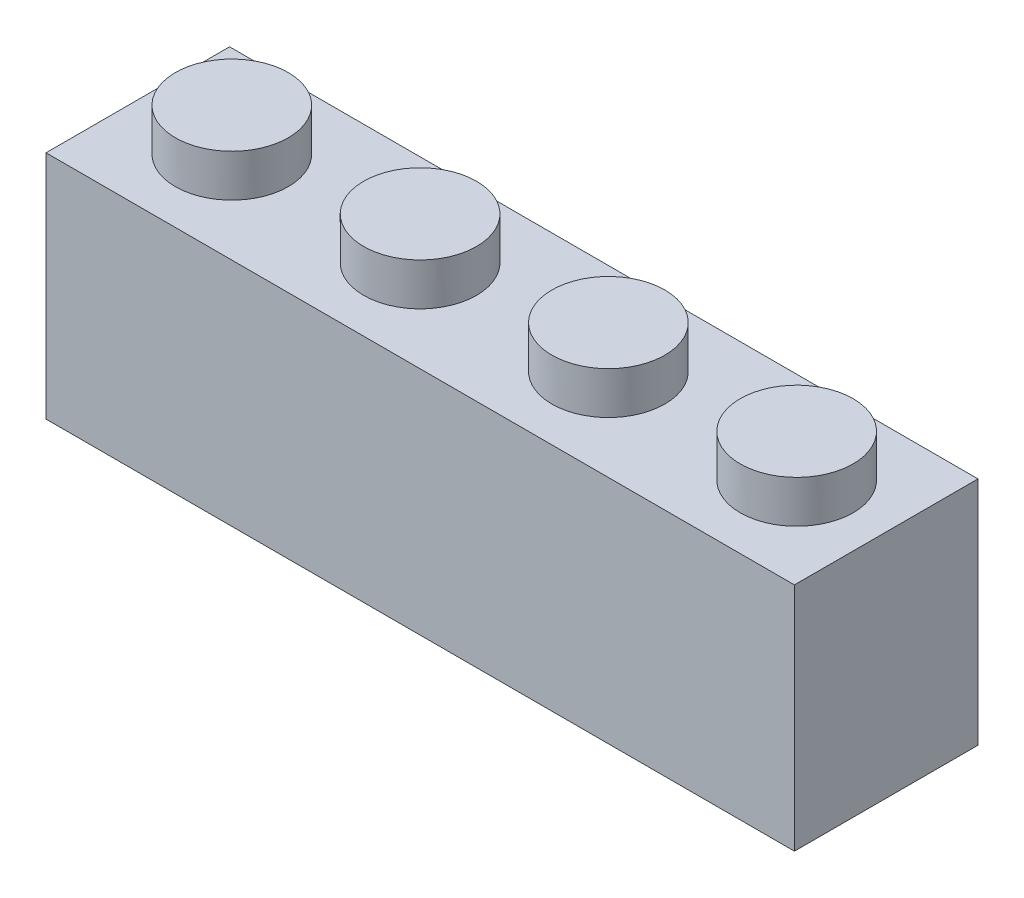
ISO-10303-21;
HEADER;
FILE_DESCRIPTION(('STEP AP214'),'2;1');
FILE_NAME('part.step','',(''),(''),'','','');
FILE_SCHEMA(('AUTOMOTIVE_DESIGN { 1 0 10303 214 1 1 1 1 }'));
ENDSEC;
DATA;
#1=APPLICATION_CONTEXT('core data for automotive mechanical design processes');
#2=APPLICATION_PROTOCOL_DEFINITION('international standard','automotive_design',2000,#1);
#3=PRODUCT_CONTEXT('',#1,'mechanical');
#4=PRODUCT('Part','Part','',(#3));
#5=PRODUCT_RELATED_PRODUCT_CATEGORY('part','',(#4));
#6=PRODUCT_DEFINITION_FORMATION('','',#4);
#7=PRODUCT_DEFINITION_CONTEXT('part definition',#1,'design');
#8=PRODUCT_DEFINITION('design','',#6,#7);
#9=PRODUCT_DEFINITION_SHAPE('','',#8);
#10=(LENGTH_UNIT() NAMED_UNIT(*) SI_UNIT(.MILLI.,.METRE.));
#11=(NAMED_UNIT(*) PLANE_ANGLE_UNIT() SI_UNIT($,.RADIAN.));
#12=(NAMED_UNIT(*) SI_UNIT($,.STERADIAN.) SOLID_ANGLE_UNIT());
#13=UNCERTAINTY_MEASURE_WITH_UNIT(LENGTH_MEASURE(1.E-05),#10,'distance_accuracy_value','');
#14=(GEOMETRIC_REPRESENTATION_CONTEXT(3) GLOBAL_UNCERTAINTY_ASSIGNED_CONTEXT((#13)) GLOBAL_UNIT_ASSIGNED_CONTEXT((#10,
#11,#12)) REPRESENTATION_CONTEXT('',''));
#15=CARTESIAN_POINT('',(0.,0.,0.));
#16=DIRECTION('',(0.,0.,1.));
#17=DIRECTION('',(1.,0.,0.));
#18=AXIS2_PLACEMENT_3D('',#15,#16,#17);
#19=CARTESIAN_POINT('',(15.9,4.9,-3.9));
#20=DIRECTION('',(-1.,0.,0.));
#21=DIRECTION('',(0.,0.,1.));
#22=AXIS2_PLACEMENT_3D('',#19,#20,#21);
#23=PLANE('',#22);
#24=DIRECTION('',(0.,0.,-1.));
#25=VECTOR('',#24,1.);
#26=CARTESIAN_POINT('',(15.9,-4.9,-3.9));
#27=LINE('',#26,#25);
#28=CARTESIAN_POINT('',(15.9,-4.9,3.9));
#29=VERTEX_POINT('',#28);
#30=CARTESIAN_POINT('',(15.9,-4.9,-3.9));
#31=VERTEX_POINT('',#30);
#32=EDGE_CURVE('E160',#29,#31,#27,.T.);
#33=ORIENTED_EDGE('',*,*,#32,.T.);
#34=DIRECTION('',(0.,-1.,0.));
#35=VECTOR('',#34,1.);
#36=CARTESIAN_POINT('',(15.9,4.9,-3.9));
#37=LINE('',#36,#35);
#38=CARTESIAN_POINT('',(15.9,4.9,-3.9));
#39=VERTEX_POINT('',#38);
#40=EDGE_CURVE('E181',#39,#31,#37,.T.);
#41=ORIENTED_EDGE('',*,*,#40,.F.);
#42=DIRECTION('',(0.,0.,-1.));
#43=VECTOR('',#42,1.);
#44=CARTESIAN_POINT('',(15.9,4.9,-3.9));
#45=LINE('',#44,#43);
#46=CARTESIAN_POINT('',(15.9,4.9,3.9));
#47=VERTEX_POINT('',#46);
#48=EDGE_CURVE('E161',#47,#39,#45,.T.);
#49=ORIENTED_EDGE('',*,*,#48,.F.);
#50=DIRECTION('',(0.,-1.,0.));
#51=VECTOR('',#50,1.);
#52=CARTESIAN_POINT('',(15.9,4.9,3.9));
#53=LINE('',#52,#51);
#54=EDGE_CURVE('E167',#47,#29,#53,.T.);
#55=ORIENTED_EDGE('',*,*,#54,.T.);
#56=EDGE_LOOP('',(#33,#41,#49,#55));
#57=FACE_BOUND('',#56,.T.);
#58=ADVANCED_FACE('F33',(#57),#23,.F.);
#59=CARTESIAN_POINT('',(-15.9,4.9,-3.9));
#60=DIRECTION('',(0.,0.,1.));
#61=DIRECTION('',(1.,0.,0.));
#62=AXIS2_PLACEMENT_3D('',#59,#60,#61);
#63=PLANE('',#62);
#64=DIRECTION('',(-1.,0.,0.));
#65=VECTOR('',#64,1.);
#66=CARTESIAN_POINT('',(-15.9,-4.9,-3.9));
#67=LINE('',#66,#65);
#68=CARTESIAN_POINT('',(-15.9,-4.9,-3.9));
#69=VERTEX_POINT('',#68);
#70=EDGE_CURVE('E170',#31,#69,#67,.T.);
#71=ORIENTED_EDGE('',*,*,#70,.T.);
#72=DIRECTION('',(0.,-1.,0.));
#73=VECTOR('',#72,1.);
#74=CARTESIAN_POINT('',(-15.9,4.9,-3.9));
#75=LINE('',#74,#73);
#76=CARTESIAN_POINT('',(-15.9,4.9,-3.9));
#77=VERTEX_POINT('',#76);
#78=EDGE_CURVE('E178',#77,#69,#75,.T.);
#79=ORIENTED_EDGE('',*,*,#78,.F.);
#80=DIRECTION('',(-1.,0.,0.));
#81=VECTOR('',#80,1.);
#82=CARTESIAN_POINT('',(-15.9,4.9,-3.9));
#83=LINE('',#82,#81);
#84=EDGE_CURVE('E85',#39,#77,#83,.T.);
#85=ORIENTED_EDGE('',*,*,#84,.F.);
#86=ORIENTED_EDGE('',*,*,#40,.T.);
#87=EDGE_LOOP('',(#71,#79,#85,#86));
#88=FACE_BOUND('',#87,.T.);
#89=ADVANCED_FACE('F220',(#88),#63,.F.);
#90=CARTESIAN_POINT('',(-15.9,4.9,-3.9));
#91=DIRECTION('',(1.,0.,0.));
#92=DIRECTION('',(0.,0.,-1.));
#93=AXIS2_PLACEMENT_3D('',#90,#91,#92);
#94=PLANE('',#93);
#95=DIRECTION('',(0.,0.,1.));
#96=VECTOR('',#95,1.);
#97=CARTESIAN_POINT('',(-15.9,-4.9,-3.9));
#98=LINE('',#97,#96);
#99=CARTESIAN_POINT('',(-15.9,-4.9,3.9));
#100=VERTEX_POINT('',#99);
#101=EDGE_CURVE('E172',#69,#100,#98,.T.);
#102=ORIENTED_EDGE('',*,*,#101,.T.);
#103=DIRECTION('',(0.,-1.,0.));
#104=VECTOR('',#103,1.);
#105=CARTESIAN_POINT('',(-15.9,4.9,3.9));
#106=LINE('',#105,#104);
#107=CARTESIAN_POINT('',(-15.9,4.9,3.9));
#108=VERTEX_POINT('',#107);
#109=EDGE_CURVE('E176',#108,#100,#106,.T.);
#110=ORIENTED_EDGE('',*,*,#109,.F.);
#111=DIRECTION('',(0.,0.,1.));
#112=VECTOR('',#111,1.);
#113=CARTESIAN_POINT('',(-15.9,4.9,-3.9));
#114=LINE('',#113,#112);
#115=EDGE_CURVE('E164',#77,#108,#114,.T.);
#116=ORIENTED_EDGE('',*,*,#115,.F.);
#117=ORIENTED_EDGE('',*,*,#78,.T.);
#118=EDGE_LOOP('',(#102,#110,#116,#117));
#119=FACE_BOUND('',#118,.T.);
#120=ADVANCED_FACE('F225',(#119),#94,.F.);
#121=CARTESIAN_POINT('',(-15.9,4.9,3.9));
#122=DIRECTION('',(0.,0.,-1.));
#123=DIRECTION('',(-1.,0.,0.));
#124=AXIS2_PLACEMENT_3D('',#121,#122,#123);
#125=PLANE('',#124);
#126=DIRECTION('',(1.,0.,0.));
#127=VECTOR('',#126,1.);
#128=CARTESIAN_POINT('',(-15.9,-4.9,3.9));
#129=LINE('',#128,#127);
#130=EDGE_CURVE('E77',#100,#29,#129,.T.);
#131=ORIENTED_EDGE('',*,*,#130,.T.);
#132=ORIENTED_EDGE('',*,*,#54,.F.);
#133=DIRECTION('',(1.,0.,0.));
#134=VECTOR('',#133,1.);
#135=CARTESIAN_POINT('',(-15.9,4.9,3.9));
#136=LINE('',#135,#134);
#137=EDGE_CURVE('E56',#108,#47,#136,.T.);
#138=ORIENTED_EDGE('',*,*,#137,.F.);
#139=ORIENTED_EDGE('',*,*,#109,.T.);
#140=EDGE_LOOP('',(#131,#132,#138,#139));
#141=FACE_BOUND('',#140,.T.);
#142=ADVANCED_FACE('F237',(#141),#125,.F.);
#143=CARTESIAN_POINT('',(0.,4.9,0.));
#144=DIRECTION('',(0.,1.,0.));
#145=DIRECTION('',(0.,0.,1.));
#146=AXIS2_PLACEMENT_3D('',#143,#144,#145);
#147=PLANE('',#146);
#148=CARTESIAN_POINT('',(12.0951920976153,4.9,0.));
#149=DIRECTION('',(0.,1.,0.));
#150=DIRECTION('',(0.,0.,1.));
#151=AXIS2_PLACEMENT_3D('',#148,#149,#150);
#152=CIRCLE('',#151,2.4);
#153=CARTESIAN_POINT('',(12.0951920976153,4.9,2.4));
#154=VERTEX_POINT('',#153);
#155=EDGE_CURVE('E192',#154,#154,#152,.T.);
#156=ORIENTED_EDGE('',*,*,#155,.F.);
#157=EDGE_LOOP('',(#156));
#158=FACE_BOUND('',#157,.T.);
#159=CARTESIAN_POINT('',(4.09519209761529,4.9,0.));
#160=DIRECTION('',(0.,1.,0.));
#161=DIRECTION('',(0.,0.,1.));
#162=AXIS2_PLACEMENT_3D('',#159,#160,#161);
#163=CIRCLE('',#162,2.4);
#164=CARTESIAN_POINT('',(4.09519209761529,4.9,2.4));
#165=VERTEX_POINT('',#164);
#166=EDGE_CURVE('E189',#165,#165,#163,.T.);
#167=ORIENTED_EDGE('',*,*,#166,.F.);
#168=EDGE_LOOP('',(#167));
#169=FACE_BOUND('',#168,.T.);
#170=CARTESIAN_POINT('',(-3.90480790238471,4.9,0.));
#171=DIRECTION('',(0.,1.,0.));
#172=DIRECTION('',(0.,0.,1.));
#173=AXIS2_PLACEMENT_3D('',#170,#171,#172);
#174=CIRCLE('',#173,2.4);
#175=CARTESIAN_POINT('',(-3.90480790238471,4.9,2.4));
#176=VERTEX_POINT('',#175);
#177=EDGE_CURVE('E186',#176,#176,#174,.T.);
#178=ORIENTED_EDGE('',*,*,#177,.F.);
#179=EDGE_LOOP('',(#178));
#180=FACE_BOUND('',#179,.T.);
#181=CARTESIAN_POINT('',(-11.9048079023847,4.9,0.));
#182=DIRECTION('',(0.,1.,0.));
#183=DIRECTION('',(0.,0.,1.));
#184=AXIS2_PLACEMENT_3D('',#181,#182,#183);
#185=CIRCLE('',#184,2.4);
#186=CARTESIAN_POINT('',(-11.9048079023847,4.9,2.4));
#187=VERTEX_POINT('',#186);
#188=EDGE_CURVE('E183',#187,#187,#185,.T.);
#189=ORIENTED_EDGE('',*,*,#188,.F.);
#190=EDGE_LOOP('',(#189));
#191=FACE_BOUND('',#190,.T.);
#192=ORIENTED_EDGE('',*,*,#48,.T.);
#193=ORIENTED_EDGE('',*,*,#84,.T.);
#194=ORIENTED_EDGE('',*,*,#115,.T.);
#195=ORIENTED_EDGE('',*,*,#137,.T.);
#196=EDGE_LOOP('',(#192,#193,#194,#195));
#197=FACE_BOUND('',#196,.T.);
#198=ADVANCED_FACE('F235',(#158,#169,#180,#191,#197),#147,.T.);
#199=CARTESIAN_POINT('',(0.,-4.9,0.));
#200=DIRECTION('',(0.,1.,0.));
#201=DIRECTION('',(0.,0.,1.));
#202=AXIS2_PLACEMENT_3D('',#199,#200,#201);
#203=PLANE('',#202);
#204=DIRECTION('',(-1.,0.,0.));
#205=VECTOR('',#204,1.);
#206=CARTESIAN_POINT('',(-14.3,-4.9,2.3));
#207=LINE('',#206,#205);
#208=CARTESIAN_POINT('',(14.3,-4.9,2.3));
#209=VERTEX_POINT('',#208);
#210=CARTESIAN_POINT('',(-14.3,-4.9,2.3));
#211=VERTEX_POINT('',#210);
#212=EDGE_CURVE('E139',#209,#211,#207,.T.);
#213=ORIENTED_EDGE('',*,*,#212,.F.);
#214=DIRECTION('',(0.,0.,1.));
#215=VECTOR('',#214,1.);
#216=CARTESIAN_POINT('',(14.3,-4.9,-2.3));
#217=LINE('',#216,#215);
#218=CARTESIAN_POINT('',(14.3,-4.9,-2.3));
#219=VERTEX_POINT('',#218);
#220=EDGE_CURVE('E47',#219,#209,#217,.T.);
#221=ORIENTED_EDGE('',*,*,#220,.F.);
#222=DIRECTION('',(1.,0.,0.));
#223=VECTOR('',#222,1.);
#224=CARTESIAN_POINT('',(-14.3,-4.9,-2.3));
#225=LINE('',#224,#223);
#226=CARTESIAN_POINT('',(-14.3,-4.9,-2.3));
#227=VERTEX_POINT('',#226);
#228=EDGE_CURVE('E127',#227,#219,#225,.T.);
#229=ORIENTED_EDGE('',*,*,#228,.F.);
#230=DIRECTION('',(0.,0.,-1.));
#231=VECTOR('',#230,1.);
#232=CARTESIAN_POINT('',(-14.3,-4.9,-2.3));
#233=LINE('',#232,#231);
#234=EDGE_CURVE('E130',#211,#227,#233,.T.);
#235=ORIENTED_EDGE('',*,*,#234,.F.);
#236=EDGE_LOOP('',(#213,#221,#229,#235));
#237=FACE_BOUND('',#236,.T.);
#238=ORIENTED_EDGE('',*,*,#32,.F.);
#239=ORIENTED_EDGE('',*,*,#130,.F.);
#240=ORIENTED_EDGE('',*,*,#101,.F.);
#241=ORIENTED_EDGE('',*,*,#70,.F.);
#242=EDGE_LOOP('',(#238,#239,#240,#241));
#243=FACE_BOUND('',#242,.T.);
#244=ADVANCED_FACE('F230',(#237,#243),#203,.F.);
#245=CARTESIAN_POINT('',(-11.9048079023847,6.7,0.));
#246=DIRECTION('',(0.,-1.,0.));
#247=DIRECTION('',(0.,0.,-1.));
#248=AXIS2_PLACEMENT_3D('',#245,#246,#247);
#249=CYLINDRICAL_SURFACE('',#248,2.4);
#250=CARTESIAN_POINT('',(-11.9048079023847,6.7,0.));
#251=DIRECTION('',(0.,-1.,0.));
#252=DIRECTION('',(0.,0.,-1.));
#253=AXIS2_PLACEMENT_3D('',#250,#251,#252);
#254=CIRCLE('',#253,2.4);
#255=CARTESIAN_POINT('',(-11.9048079023847,6.7,-2.4));
#256=VERTEX_POINT('',#255);
#257=EDGE_CURVE('E157',#256,#256,#254,.T.);
#258=ORIENTED_EDGE('',*,*,#257,.T.);
#259=EDGE_LOOP('',(#258));
#260=FACE_BOUND('',#259,.T.);
#261=ORIENTED_EDGE('',*,*,#188,.T.);
#262=EDGE_LOOP('',(#261));
#263=FACE_BOUND('',#262,.T.);
#264=ADVANCED_FACE('F244',(#260,#263),#249,.T.);
#265=CARTESIAN_POINT('',(-11.9048079023847,6.7,0.));
#266=DIRECTION('',(0.,-1.,0.));
#267=DIRECTION('',(0.,0.,-1.));
#268=AXIS2_PLACEMENT_3D('',#265,#266,#267);
#269=PLANE('',#268);
#270=ORIENTED_EDGE('',*,*,#257,.F.);
#271=EDGE_LOOP('',(#270));
#272=FACE_BOUND('',#271,.T.);
#273=ADVANCED_FACE('F276',(#272),#269,.F.);
#274=CARTESIAN_POINT('',(-3.90480790238471,6.7,0.));
#275=DIRECTION('',(0.,-1.,0.));
#276=DIRECTION('',(0.,0.,-1.));
#277=AXIS2_PLACEMENT_3D('',#274,#275,#276);
#278=CYLINDRICAL_SURFACE('',#277,2.4);
#279=CARTESIAN_POINT('',(-3.90480790238471,6.7,0.));
#280=DIRECTION('',(0.,-1.,0.));
#281=DIRECTION('',(0.,0.,-1.));
#282=AXIS2_PLACEMENT_3D('',#279,#280,#281);
#283=CIRCLE('',#282,2.4);
#284=CARTESIAN_POINT('',(-3.90480790238471,6.7,-2.4));
#285=VERTEX_POINT('',#284);
#286=EDGE_CURVE('E154',#285,#285,#283,.T.);
#287=ORIENTED_EDGE('',*,*,#286,.T.);
#288=EDGE_LOOP('',(#287));
#289=FACE_BOUND('',#288,.T.);
#290=ORIENTED_EDGE('',*,*,#177,.T.);
#291=EDGE_LOOP('',(#290));
#292=FACE_BOUND('',#291,.T.);
#293=ADVANCED_FACE('F285',(#289,#292),#278,.T.);
#294=CARTESIAN_POINT('',(-3.90480790238471,6.7,0.));
#295=DIRECTION('',(0.,-1.,0.));
#296=DIRECTION('',(0.,0.,-1.));
#297=AXIS2_PLACEMENT_3D('',#294,#295,#296);
#298=PLANE('',#297);
#299=ORIENTED_EDGE('',*,*,#286,.F.);
#300=EDGE_LOOP('',(#299));
#301=FACE_BOUND('',#300,.T.);
#302=ADVANCED_FACE('F294',(#301),#298,.F.);
#303=CARTESIAN_POINT('',(4.09519209761529,6.7,0.));
#304=DIRECTION('',(0.,-1.,0.));
#305=DIRECTION('',(0.,0.,-1.));
#306=AXIS2_PLACEMENT_3D('',#303,#304,#305);
#307=CYLINDRICAL_SURFACE('',#306,2.4);
#308=CARTESIAN_POINT('',(4.09519209761529,6.7,0.));
#309=DIRECTION('',(0.,-1.,0.));
#310=DIRECTION('',(0.,0.,-1.));
#311=AXIS2_PLACEMENT_3D('',#308,#309,#310);
#312=CIRCLE('',#311,2.4);
#313=CARTESIAN_POINT('',(4.09519209761529,6.7,-2.4));
#314=VERTEX_POINT('',#313);
#315=EDGE_CURVE('E151',#314,#314,#312,.T.);
#316=ORIENTED_EDGE('',*,*,#315,.T.);
#317=EDGE_LOOP('',(#316));
#318=FACE_BOUND('',#317,.T.);
#319=ORIENTED_EDGE('',*,*,#166,.T.);
#320=EDGE_LOOP('',(#319));
#321=FACE_BOUND('',#320,.T.);
#322=ADVANCED_FACE('F304',(#318,#321),#307,.T.);
#323=CARTESIAN_POINT('',(4.09519209761529,6.7,0.));
#324=DIRECTION('',(0.,-1.,0.));
#325=DIRECTION('',(0.,0.,-1.));
#326=AXIS2_PLACEMENT_3D('',#323,#324,#325);
#327=PLANE('',#326);
#328=ORIENTED_EDGE('',*,*,#315,.F.);
#329=EDGE_LOOP('',(#328));
#330=FACE_BOUND('',#329,.T.);
#331=ADVANCED_FACE('F314',(#330),#327,.F.);
#332=CARTESIAN_POINT('',(12.0951920976153,6.7,0.));
#333=DIRECTION('',(0.,-1.,0.));
#334=DIRECTION('',(0.,0.,-1.));
#335=AXIS2_PLACEMENT_3D('',#332,#333,#334);
#336=CYLINDRICAL_SURFACE('',#335,2.4);
#337=CARTESIAN_POINT('',(12.0951920976153,6.7,0.));
#338=DIRECTION('',(0.,-1.,0.));
#339=DIRECTION('',(0.,0.,-1.));
#340=AXIS2_PLACEMENT_3D('',#337,#338,#339);
#341=CIRCLE('',#340,2.4);
#342=CARTESIAN_POINT('',(12.0951920976153,6.7,-2.4));
#343=VERTEX_POINT('',#342);
#344=EDGE_CURVE('E145',#343,#343,#341,.T.);
#345=ORIENTED_EDGE('',*,*,#344,.T.);
#346=EDGE_LOOP('',(#345));
#347=FACE_BOUND('',#346,.T.);
#348=ORIENTED_EDGE('',*,*,#155,.T.);
#349=EDGE_LOOP('',(#348));
#350=FACE_BOUND('',#349,.T.);
#351=ADVANCED_FACE('F324',(#347,#350),#336,.T.);
#352=CARTESIAN_POINT('',(12.0951920976153,6.7,0.));
#353=DIRECTION('',(0.,-1.,0.));
#354=DIRECTION('',(0.,0.,-1.));
#355=AXIS2_PLACEMENT_3D('',#352,#353,#354);
#356=PLANE('',#355);
#357=ORIENTED_EDGE('',*,*,#344,.F.);
#358=EDGE_LOOP('',(#357));
#359=FACE_BOUND('',#358,.T.);
#360=ADVANCED_FACE('F334',(#359),#356,.F.);
#361=CARTESIAN_POINT('',(14.3,3.1,-2.3));
#362=DIRECTION('',(1.,0.,0.));
#363=DIRECTION('',(0.,0.,-1.));
#364=AXIS2_PLACEMENT_3D('',#361,#362,#363);
#365=PLANE('',#364);
#366=ORIENTED_EDGE('',*,*,#220,.T.);
#367=DIRECTION('',(0.,-1.,0.));
#368=VECTOR('',#367,1.);
#369=CARTESIAN_POINT('',(14.3,3.1,2.3));
#370=LINE('',#369,#368);
#371=CARTESIAN_POINT('',(14.3,3.1,2.3));
#372=VERTEX_POINT('',#371);
#373=EDGE_CURVE('E105',#372,#209,#370,.T.);
#374=ORIENTED_EDGE('',*,*,#373,.F.);
#375=DIRECTION('',(0.,0.,1.));
#376=VECTOR('',#375,1.);
#377=CARTESIAN_POINT('',(14.3,3.1,-2.3));
#378=LINE('',#377,#376);
#379=CARTESIAN_POINT('',(14.3,3.1,-2.3));
#380=VERTEX_POINT('',#379);
#381=EDGE_CURVE('E109',#380,#372,#378,.T.);
#382=ORIENTED_EDGE('',*,*,#381,.F.);
#383=DIRECTION('',(0.,-1.,0.));
#384=VECTOR('',#383,1.);
#385=CARTESIAN_POINT('',(14.3,3.1,-2.3));
#386=LINE('',#385,#384);
#387=EDGE_CURVE('E143',#380,#219,#386,.T.);
#388=ORIENTED_EDGE('',*,*,#387,.T.);
#389=EDGE_LOOP('',(#366,#374,#382,#388));
#390=FACE_BOUND('',#389,.T.);
#391=ADVANCED_FACE('F107',(#390),#365,.F.);
#392=CARTESIAN_POINT('',(-14.3,3.1,-2.3));
#393=DIRECTION('',(0.,0.,-1.));
#394=DIRECTION('',(-1.,0.,0.));
#395=AXIS2_PLACEMENT_3D('',#392,#393,#394);
#396=PLANE('',#395);
#397=ORIENTED_EDGE('',*,*,#228,.T.);
#398=ORIENTED_EDGE('',*,*,#387,.F.);
#399=DIRECTION('',(1.,0.,0.));
#400=VECTOR('',#399,1.);
#401=CARTESIAN_POINT('',(-14.3,3.1,-2.3));
#402=LINE('',#401,#400);
#403=CARTESIAN_POINT('',(-14.3,3.1,-2.3));
#404=VERTEX_POINT('',#403);
#405=EDGE_CURVE('E115',#404,#380,#402,.T.);
#406=ORIENTED_EDGE('',*,*,#405,.F.);
#407=DIRECTION('',(0.,-1.,0.));
#408=VECTOR('',#407,1.);
#409=CARTESIAN_POINT('',(-14.3,3.1,-2.3));
#410=LINE('',#409,#408);
#411=EDGE_CURVE('E146',#404,#227,#410,.T.);
#412=ORIENTED_EDGE('',*,*,#411,.T.);
#413=EDGE_LOOP('',(#397,#398,#406,#412));
#414=FACE_BOUND('',#413,.T.);
#415=ADVANCED_FACE('F358',(#414),#396,.F.);
#416=CARTESIAN_POINT('',(-14.3,3.1,-2.3));
#417=DIRECTION('',(-1.,0.,0.));
#418=DIRECTION('',(0.,0.,1.));
#419=AXIS2_PLACEMENT_3D('',#416,#417,#418);
#420=PLANE('',#419);
#421=ORIENTED_EDGE('',*,*,#234,.T.);
#422=ORIENTED_EDGE('',*,*,#411,.F.);
#423=DIRECTION('',(0.,0.,-1.));
#424=VECTOR('',#423,1.);
#425=CARTESIAN_POINT('',(-14.3,3.1,-2.3));
#426=LINE('',#425,#424);
#427=CARTESIAN_POINT('',(-14.3,3.1,2.3));
#428=VERTEX_POINT('',#427);
#429=EDGE_CURVE('E123',#428,#404,#426,.T.);
#430=ORIENTED_EDGE('',*,*,#429,.F.);
#431=DIRECTION('',(0.,-1.,0.));
#432=VECTOR('',#431,1.);
#433=CARTESIAN_POINT('',(-14.3,3.1,2.3));
#434=LINE('',#433,#432);
#435=EDGE_CURVE('E114',#428,#211,#434,.T.);
#436=ORIENTED_EDGE('',*,*,#435,.T.);
#437=EDGE_LOOP('',(#421,#422,#430,#436));
#438=FACE_BOUND('',#437,.T.);
#439=ADVANCED_FACE('F367',(#438),#420,.F.);
#440=CARTESIAN_POINT('',(-14.3,3.1,2.3));
#441=DIRECTION('',(0.,0.,1.));
#442=DIRECTION('',(1.,0.,0.));
#443=AXIS2_PLACEMENT_3D('',#440,#441,#442);
#444=PLANE('',#443);
#445=ORIENTED_EDGE('',*,*,#212,.T.);
#446=ORIENTED_EDGE('',*,*,#435,.F.);
#447=DIRECTION('',(-1.,0.,0.));
#448=VECTOR('',#447,1.);
#449=CARTESIAN_POINT('',(-14.3,3.1,2.3));
#450=LINE('',#449,#448);
#451=EDGE_CURVE('E118',#372,#428,#450,.T.);
#452=ORIENTED_EDGE('',*,*,#451,.F.);
#453=ORIENTED_EDGE('',*,*,#373,.T.);
#454=EDGE_LOOP('',(#445,#446,#452,#453));
#455=FACE_BOUND('',#454,.T.);
#456=ADVANCED_FACE('F119',(#455),#444,.F.);
#457=CARTESIAN_POINT('',(0.,3.1,0.));
#458=DIRECTION('',(0.,1.,0.));
#459=DIRECTION('',(0.,0.,1.));
#460=AXIS2_PLACEMENT_3D('',#457,#458,#459);
#461=PLANE('',#460);
#462=CARTESIAN_POINT('',(-7.95,3.1,0.));
#463=DIRECTION('',(0.,1.,0.));
#464=DIRECTION('',(0.,0.,1.));
#465=AXIS2_PLACEMENT_3D('',#462,#463,#464);
#466=CIRCLE('',#465,1.5);
#467=CARTESIAN_POINT('',(-7.95,3.1,1.5));
#468=VERTEX_POINT('',#467);
#469=EDGE_CURVE('E11',#468,#468,#466,.F.);
#470=ORIENTED_EDGE('',*,*,#469,.F.);
#471=EDGE_LOOP('',(#470));
#472=FACE_BOUND('',#471,.T.);
#473=CARTESIAN_POINT('',(0.,3.1,0.));
#474=DIRECTION('',(0.,1.,0.));
#475=DIRECTION('',(0.,0.,1.));
#476=AXIS2_PLACEMENT_3D('',#473,#474,#475);
#477=CIRCLE('',#476,1.5);
#478=CARTESIAN_POINT('',(0.,3.1,1.5));
#479=VERTEX_POINT('',#478);
#480=EDGE_CURVE('E40',#479,#479,#477,.F.);
#481=ORIENTED_EDGE('',*,*,#480,.F.);
#482=EDGE_LOOP('',(#481));
#483=FACE_BOUND('',#482,.T.);
#484=CARTESIAN_POINT('',(7.95,3.1,0.));
#485=DIRECTION('',(0.,1.,0.));
#486=DIRECTION('',(0.,0.,1.));
#487=AXIS2_PLACEMENT_3D('',#484,#485,#486);
#488=CIRCLE('',#487,1.5);
#489=CARTESIAN_POINT('',(7.95,3.1,1.5));
#490=VERTEX_POINT('',#489);
#491=EDGE_CURVE('E195',#490,#490,#488,.F.);
#492=ORIENTED_EDGE('',*,*,#491,.F.);
#493=EDGE_LOOP('',(#492));
#494=FACE_BOUND('',#493,.T.);
#495=ORIENTED_EDGE('',*,*,#381,.T.);
#496=ORIENTED_EDGE('',*,*,#451,.T.);
#497=ORIENTED_EDGE('',*,*,#429,.T.);
#498=ORIENTED_EDGE('',*,*,#405,.T.);
#499=EDGE_LOOP('',(#495,#496,#497,#498));
#500=FACE_BOUND('',#499,.T.);
#501=ADVANCED_FACE('F125',(#472,#483,#494,#500),#461,.F.);
#502=CARTESIAN_POINT('',(7.95,-4.7,0.));
#503=DIRECTION('',(0.,1.,0.));
#504=DIRECTION('',(0.,0.,1.));
#505=AXIS2_PLACEMENT_3D('',#502,#503,#504);
#506=CYLINDRICAL_SURFACE('',#505,1.5);
#507=CARTESIAN_POINT('',(7.95,-4.7,0.));
#508=DIRECTION('',(0.,-1.,0.));
#509=DIRECTION('',(0.,0.,-1.));
#510=AXIS2_PLACEMENT_3D('',#507,#508,#509);
#511=CIRCLE('',#510,1.5);
#512=CARTESIAN_POINT('',(7.95,-4.7,-1.5));
#513=VERTEX_POINT('',#512);
#514=EDGE_CURVE('E133',#513,#513,#511,.T.);
#515=ORIENTED_EDGE('',*,*,#514,.F.);
#516=EDGE_LOOP('',(#515));
#517=FACE_BOUND('',#516,.T.);
#518=ORIENTED_EDGE('',*,*,#491,.T.);
#519=EDGE_LOOP('',(#518));
#520=FACE_BOUND('',#519,.T.);
#521=ADVANCED_FACE('F204',(#517,#520),#506,.T.);
#522=CARTESIAN_POINT('',(7.95,-4.7,0.));
#523=DIRECTION('',(0.,-1.,0.));
#524=DIRECTION('',(0.,0.,-1.));
#525=AXIS2_PLACEMENT_3D('',#522,#523,#524);
#526=PLANE('',#525);
#527=ORIENTED_EDGE('',*,*,#514,.T.);
#528=EDGE_LOOP('',(#527));
#529=FACE_BOUND('',#528,.T.);
#530=ADVANCED_FACE('F210',(#529),#526,.T.);
#531=CARTESIAN_POINT('',(0.,-4.7,0.));
#532=DIRECTION('',(0.,1.,0.));
#533=DIRECTION('',(0.,0.,1.));
#534=AXIS2_PLACEMENT_3D('',#531,#532,#533);
#535=CYLINDRICAL_SURFACE('',#534,1.5);
#536=CARTESIAN_POINT('',(0.,-4.7,0.));
#537=DIRECTION('',(0.,-1.,0.));
#538=DIRECTION('',(0.,0.,-1.));
#539=AXIS2_PLACEMENT_3D('',#536,#537,#538);
#540=CIRCLE('',#539,1.5);
#541=CARTESIAN_POINT('',(0.,-4.7,-1.5));
#542=VERTEX_POINT('',#541);
#543=EDGE_CURVE('E447',#542,#542,#540,.T.);
#544=ORIENTED_EDGE('',*,*,#543,.F.);
#545=EDGE_LOOP('',(#544));
#546=FACE_BOUND('',#545,.T.);
#547=ORIENTED_EDGE('',*,*,#480,.T.);
#548=EDGE_LOOP('',(#547));
#549=FACE_BOUND('',#548,.T.);
#550=ADVANCED_FACE('F200',(#546,#549),#535,.T.);
#551=CARTESIAN_POINT('',(0.,-4.7,0.));
#552=DIRECTION('',(0.,-1.,0.));
#553=DIRECTION('',(0.,0.,-1.));
#554=AXIS2_PLACEMENT_3D('',#551,#552,#553);
#555=PLANE('',#554);
#556=ORIENTED_EDGE('',*,*,#543,.T.);
#557=EDGE_LOOP('',(#556));
#558=FACE_BOUND('',#557,.T.);
#559=ADVANCED_FACE('F410',(#558),#555,.T.);
#560=CARTESIAN_POINT('',(-7.95,-4.7,0.));
#561=DIRECTION('',(0.,1.,0.));
#562=DIRECTION('',(0.,0.,1.));
#563=AXIS2_PLACEMENT_3D('',#560,#561,#562);
#564=CYLINDRICAL_SURFACE('',#563,1.5);
#565=CARTESIAN_POINT('',(-7.95,-4.7,0.));
#566=DIRECTION('',(0.,-1.,0.));
#567=DIRECTION('',(0.,0.,-1.));
#568=AXIS2_PLACEMENT_3D('',#565,#566,#567);
#569=CIRCLE('',#568,1.5);
#570=CARTESIAN_POINT('',(-7.95,-4.7,-1.5));
#571=VERTEX_POINT('',#570);
#572=EDGE_CURVE('E446',#571,#571,#569,.T.);
#573=ORIENTED_EDGE('',*,*,#572,.F.);
#574=EDGE_LOOP('',(#573));
#575=FACE_BOUND('',#574,.T.);
#576=ORIENTED_EDGE('',*,*,#469,.T.);
#577=EDGE_LOOP('',(#576));
#578=FACE_BOUND('',#577,.T.);
#579=ADVANCED_FACE('F420',(#575,#578),#564,.T.);
#580=CARTESIAN_POINT('',(-7.95,-4.7,0.));
#581=DIRECTION('',(0.,-1.,0.));
#582=DIRECTION('',(0.,0.,-1.));
#583=AXIS2_PLACEMENT_3D('',#580,#581,#582);
#584=PLANE('',#583);
#585=ORIENTED_EDGE('',*,*,#572,.T.);
#586=EDGE_LOOP('',(#585));
#587=FACE_BOUND('',#586,.T.);
#588=ADVANCED_FACE('F430',(#587),#584,.T.);
#589=CLOSED_SHELL('',(#58,#89,#120,#142,#198,#244,#264,#273,#293,#302,#322,#331,#351,#360,#391,
#415,#439,#456,#501,#521,#530,#550,#559,#579,#588));
#590=MANIFOLD_SOLID_BREP('B2',#589);
#591=ADVANCED_BREP_SHAPE_REPRESENTATION('',(#18,#590),#14);
#592=SHAPE_DEFINITION_REPRESENTATION(#9,#591);
ENDSEC;
END-ISO-10303-21;
